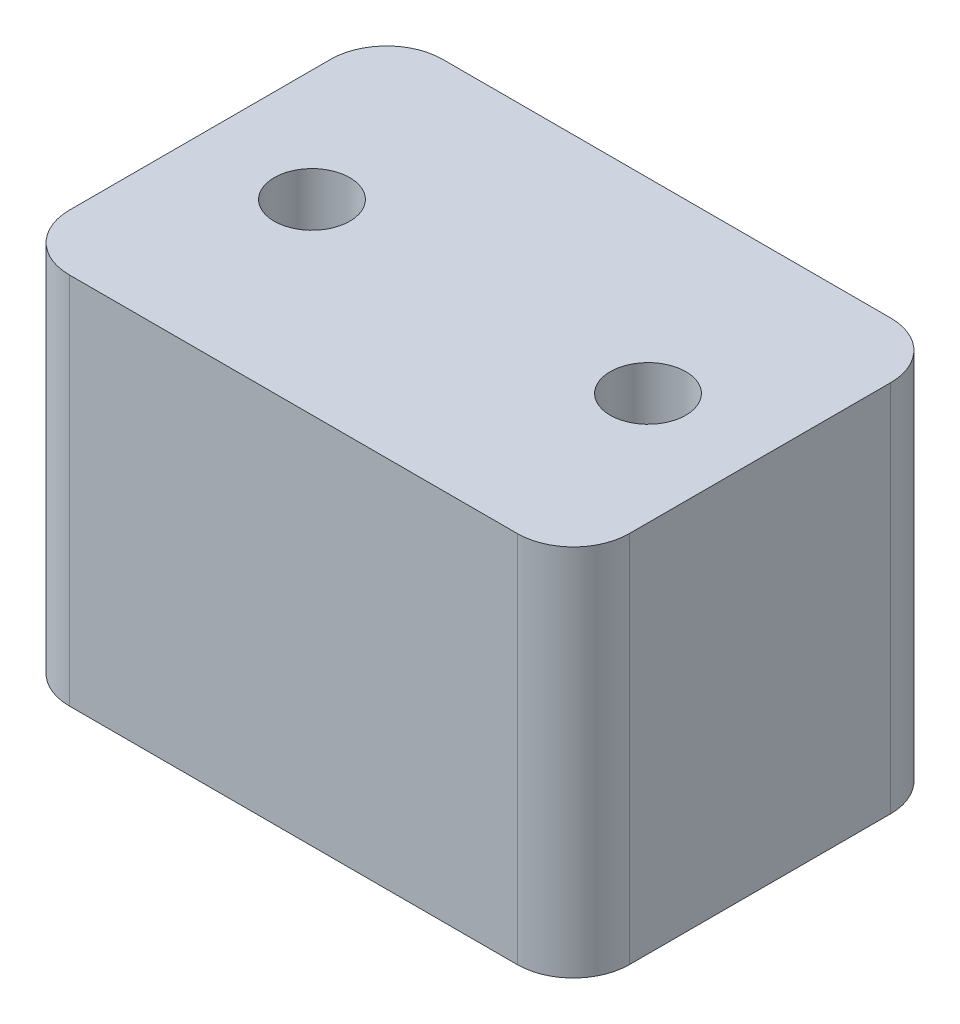
ISO-10303-21;
HEADER;
FILE_DESCRIPTION(('STEP AP214'),'2;1');
FILE_NAME('part.step','',(''),(''),'','','');
FILE_SCHEMA(('AUTOMOTIVE_DESIGN { 1 0 10303 214 1 1 1 1 }'));
ENDSEC;
DATA;
#1=APPLICATION_CONTEXT('core data for automotive mechanical design processes');
#2=APPLICATION_PROTOCOL_DEFINITION('international standard','automotive_design',2000,#1);
#3=PRODUCT_CONTEXT('',#1,'mechanical');
#4=PRODUCT('Part','Part','',(#3));
#5=PRODUCT_RELATED_PRODUCT_CATEGORY('part','',(#4));
#6=PRODUCT_DEFINITION_FORMATION('','',#4);
#7=PRODUCT_DEFINITION_CONTEXT('part definition',#1,'design');
#8=PRODUCT_DEFINITION('design','',#6,#7);
#9=PRODUCT_DEFINITION_SHAPE('','',#8);
#10=(LENGTH_UNIT() NAMED_UNIT(*) SI_UNIT(.MILLI.,.METRE.));
#11=(NAMED_UNIT(*) PLANE_ANGLE_UNIT() SI_UNIT($,.RADIAN.));
#12=(NAMED_UNIT(*) SI_UNIT($,.STERADIAN.) SOLID_ANGLE_UNIT());
#13=UNCERTAINTY_MEASURE_WITH_UNIT(LENGTH_MEASURE(1.E-05),#10,'distance_accuracy_value','');
#14=(GEOMETRIC_REPRESENTATION_CONTEXT(3) GLOBAL_UNCERTAINTY_ASSIGNED_CONTEXT((#13)) GLOBAL_UNIT_ASSIGNED_CONTEXT((#10,
#11,#12)) REPRESENTATION_CONTEXT('',''));
#15=CARTESIAN_POINT('',(0.,0.,0.));
#16=DIRECTION('',(0.,0.,1.));
#17=DIRECTION('',(1.,0.,0.));
#18=AXIS2_PLACEMENT_3D('',#15,#16,#17);
#19=CARTESIAN_POINT('',(15.,20.,10.));
#20=DIRECTION('',(-1.,0.,0.));
#21=DIRECTION('',(0.,0.,1.));
#22=AXIS2_PLACEMENT_3D('',#19,#20,#21);
#23=PLANE('',#22);
#24=DIRECTION('',(0.,0.,-1.));
#25=VECTOR('',#24,1.);
#26=CARTESIAN_POINT('',(15.,0.,10.));
#27=LINE('',#26,#25);
#28=CARTESIAN_POINT('',(15.,0.,7.));
#29=VERTEX_POINT('',#28);
#30=CARTESIAN_POINT('',(15.,0.,-7.));
#31=VERTEX_POINT('',#30);
#32=EDGE_CURVE('E182',#29,#31,#27,.T.);
#33=ORIENTED_EDGE('',*,*,#32,.T.);
#34=DIRECTION('',(0.,-1.,0.));
#35=VECTOR('',#34,1.);
#36=CARTESIAN_POINT('',(15.,20.,-7.));
#37=LINE('',#36,#35);
#38=CARTESIAN_POINT('',(15.,20.,-7.));
#39=VERTEX_POINT('',#38);
#40=EDGE_CURVE('E11',#31,#39,#37,.F.);
#41=ORIENTED_EDGE('',*,*,#40,.T.);
#42=DIRECTION('',(0.,0.,-1.));
#43=VECTOR('',#42,1.);
#44=CARTESIAN_POINT('',(15.,20.,10.));
#45=LINE('',#44,#43);
#46=CARTESIAN_POINT('',(15.,20.,7.));
#47=VERTEX_POINT('',#46);
#48=EDGE_CURVE('E135',#47,#39,#45,.T.);
#49=ORIENTED_EDGE('',*,*,#48,.F.);
#50=DIRECTION('',(0.,-1.,0.));
#51=VECTOR('',#50,1.);
#52=CARTESIAN_POINT('',(15.,20.,7.));
#53=LINE('',#52,#51);
#54=EDGE_CURVE('E48',#47,#29,#53,.T.);
#55=ORIENTED_EDGE('',*,*,#54,.T.);
#56=EDGE_LOOP('',(#33,#41,#49,#55));
#57=FACE_BOUND('',#56,.T.);
#58=ADVANCED_FACE('F39',(#57),#23,.F.);
#59=CARTESIAN_POINT('',(-15.,20.,-10.));
#60=DIRECTION('',(0.,0.,1.));
#61=DIRECTION('',(1.,0.,0.));
#62=AXIS2_PLACEMENT_3D('',#59,#60,#61);
#63=PLANE('',#62);
#64=DIRECTION('',(-1.,0.,0.));
#65=VECTOR('',#64,1.);
#66=CARTESIAN_POINT('',(-15.,0.,-10.));
#67=LINE('',#66,#65);
#68=CARTESIAN_POINT('',(12.,0.,-10.));
#69=VERTEX_POINT('',#68);
#70=CARTESIAN_POINT('',(-12.,0.,-10.));
#71=VERTEX_POINT('',#70);
#72=EDGE_CURVE('E144',#69,#71,#67,.T.);
#73=ORIENTED_EDGE('',*,*,#72,.T.);
#74=DIRECTION('',(0.,-1.,0.));
#75=VECTOR('',#74,1.);
#76=CARTESIAN_POINT('',(-12.,20.,-10.));
#77=LINE('',#76,#75);
#78=CARTESIAN_POINT('',(-12.,20.,-10.));
#79=VERTEX_POINT('',#78);
#80=EDGE_CURVE('E55',#71,#79,#77,.F.);
#81=ORIENTED_EDGE('',*,*,#80,.T.);
#82=DIRECTION('',(-1.,0.,0.));
#83=VECTOR('',#82,1.);
#84=CARTESIAN_POINT('',(-15.,20.,-10.));
#85=LINE('',#84,#83);
#86=CARTESIAN_POINT('',(12.,20.,-10.));
#87=VERTEX_POINT('',#86);
#88=EDGE_CURVE('E141',#87,#79,#85,.T.);
#89=ORIENTED_EDGE('',*,*,#88,.F.);
#90=DIRECTION('',(0.,-1.,0.));
#91=VECTOR('',#90,1.);
#92=CARTESIAN_POINT('',(12.,20.,-10.));
#93=LINE('',#92,#91);
#94=EDGE_CURVE('E172',#87,#69,#93,.T.);
#95=ORIENTED_EDGE('',*,*,#94,.T.);
#96=EDGE_LOOP('',(#73,#81,#89,#95));
#97=FACE_BOUND('',#96,.T.);
#98=ADVANCED_FACE('F230',(#97),#63,.F.);
#99=CARTESIAN_POINT('',(-15.,20.,10.));
#100=DIRECTION('',(1.,0.,0.));
#101=DIRECTION('',(0.,0.,-1.));
#102=AXIS2_PLACEMENT_3D('',#99,#100,#101);
#103=PLANE('',#102);
#104=DIRECTION('',(0.,0.,1.));
#105=VECTOR('',#104,1.);
#106=CARTESIAN_POINT('',(-15.,0.,10.));
#107=LINE('',#106,#105);
#108=CARTESIAN_POINT('',(-15.,0.,-7.));
#109=VERTEX_POINT('',#108);
#110=CARTESIAN_POINT('',(-15.,0.,7.));
#111=VERTEX_POINT('',#110);
#112=EDGE_CURVE('E136',#109,#111,#107,.T.);
#113=ORIENTED_EDGE('',*,*,#112,.T.);
#114=DIRECTION('',(0.,-1.,0.));
#115=VECTOR('',#114,1.);
#116=CARTESIAN_POINT('',(-15.,20.,7.));
#117=LINE('',#116,#115);
#118=CARTESIAN_POINT('',(-15.,20.,7.));
#119=VERTEX_POINT('',#118);
#120=EDGE_CURVE('E111',#111,#119,#117,.F.);
#121=ORIENTED_EDGE('',*,*,#120,.T.);
#122=DIRECTION('',(0.,0.,1.));
#123=VECTOR('',#122,1.);
#124=CARTESIAN_POINT('',(-15.,20.,10.));
#125=LINE('',#124,#123);
#126=CARTESIAN_POINT('',(-15.,20.,-7.));
#127=VERTEX_POINT('',#126);
#128=EDGE_CURVE('E198',#127,#119,#125,.T.);
#129=ORIENTED_EDGE('',*,*,#128,.F.);
#130=DIRECTION('',(0.,-1.,0.));
#131=VECTOR('',#130,1.);
#132=CARTESIAN_POINT('',(-15.,20.,-7.));
#133=LINE('',#132,#131);
#134=EDGE_CURVE('E117',#127,#109,#133,.T.);
#135=ORIENTED_EDGE('',*,*,#134,.T.);
#136=EDGE_LOOP('',(#113,#121,#129,#135));
#137=FACE_BOUND('',#136,.T.);
#138=ADVANCED_FACE('F227',(#137),#103,.F.);
#139=CARTESIAN_POINT('',(-15.,20.,10.));
#140=DIRECTION('',(0.,0.,-1.));
#141=DIRECTION('',(-1.,0.,0.));
#142=AXIS2_PLACEMENT_3D('',#139,#140,#141);
#143=PLANE('',#142);
#144=DIRECTION('',(1.,0.,0.));
#145=VECTOR('',#144,1.);
#146=CARTESIAN_POINT('',(-15.,20.,10.));
#147=LINE('',#146,#145);
#148=CARTESIAN_POINT('',(-12.,20.,10.));
#149=VERTEX_POINT('',#148);
#150=CARTESIAN_POINT('',(12.,20.,10.));
#151=VERTEX_POINT('',#150);
#152=EDGE_CURVE('E127',#149,#151,#147,.T.);
#153=ORIENTED_EDGE('',*,*,#152,.F.);
#154=DIRECTION('',(0.,-1.,0.));
#155=VECTOR('',#154,1.);
#156=CARTESIAN_POINT('',(-12.,20.,10.));
#157=LINE('',#156,#155);
#158=CARTESIAN_POINT('',(-12.,0.,10.));
#159=VERTEX_POINT('',#158);
#160=EDGE_CURVE('E110',#149,#159,#157,.T.);
#161=ORIENTED_EDGE('',*,*,#160,.T.);
#162=DIRECTION('',(1.,0.,0.));
#163=VECTOR('',#162,1.);
#164=CARTESIAN_POINT('',(-15.,0.,10.));
#165=LINE('',#164,#163);
#166=CARTESIAN_POINT('',(12.,0.,10.));
#167=VERTEX_POINT('',#166);
#168=EDGE_CURVE('E124',#159,#167,#165,.T.);
#169=ORIENTED_EDGE('',*,*,#168,.T.);
#170=DIRECTION('',(0.,-1.,0.));
#171=VECTOR('',#170,1.);
#172=CARTESIAN_POINT('',(12.,20.,10.));
#173=LINE('',#172,#171);
#174=EDGE_CURVE('E130',#167,#151,#173,.F.);
#175=ORIENTED_EDGE('',*,*,#174,.T.);
#176=EDGE_LOOP('',(#153,#161,#169,#175));
#177=FACE_BOUND('',#176,.T.);
#178=ADVANCED_FACE('F123',(#177),#143,.F.);
#179=CARTESIAN_POINT('',(0.,20.,0.));
#180=DIRECTION('',(0.,-1.,0.));
#181=DIRECTION('',(0.,0.,-1.));
#182=AXIS2_PLACEMENT_3D('',#179,#180,#181);
#183=PLANE('',#182);
#184=CARTESIAN_POINT('',(-9.,20.,0.));
#185=DIRECTION('',(0.,1.,0.));
#186=DIRECTION('',(0.,0.,1.));
#187=AXIS2_PLACEMENT_3D('',#184,#185,#186);
#188=CIRCLE('',#187,2.025);
#189=CARTESIAN_POINT('',(-9.,20.,2.025));
#190=VERTEX_POINT('',#189);
#191=EDGE_CURVE('E193',#190,#190,#188,.T.);
#192=ORIENTED_EDGE('',*,*,#191,.F.);
#193=EDGE_LOOP('',(#192));
#194=FACE_BOUND('',#193,.T.);
#195=CARTESIAN_POINT('',(9.,20.,0.));
#196=DIRECTION('',(0.,1.,0.));
#197=DIRECTION('',(0.,0.,1.));
#198=AXIS2_PLACEMENT_3D('',#195,#196,#197);
#199=CIRCLE('',#198,2.025);
#200=CARTESIAN_POINT('',(9.,20.,2.025));
#201=VERTEX_POINT('',#200);
#202=EDGE_CURVE('E204',#201,#201,#199,.T.);
#203=ORIENTED_EDGE('',*,*,#202,.F.);
#204=EDGE_LOOP('',(#203));
#205=FACE_BOUND('',#204,.T.);
#206=ORIENTED_EDGE('',*,*,#128,.T.);
#207=CARTESIAN_POINT('',(-12.,20.,7.));
#208=DIRECTION('',(0.,-1.,0.));
#209=DIRECTION('',(0.,0.,-1.));
#210=AXIS2_PLACEMENT_3D('',#207,#208,#209);
#211=CIRCLE('',#210,3.);
#212=EDGE_CURVE('E169',#119,#149,#211,.F.);
#213=ORIENTED_EDGE('',*,*,#212,.T.);
#214=ORIENTED_EDGE('',*,*,#152,.T.);
#215=CARTESIAN_POINT('',(12.,20.,7.));
#216=DIRECTION('',(0.,-1.,0.));
#217=DIRECTION('',(0.,0.,-1.));
#218=AXIS2_PLACEMENT_3D('',#215,#216,#217);
#219=CIRCLE('',#218,3.);
#220=EDGE_CURVE('E161',#151,#47,#219,.F.);
#221=ORIENTED_EDGE('',*,*,#220,.T.);
#222=ORIENTED_EDGE('',*,*,#48,.T.);
#223=CARTESIAN_POINT('',(12.,20.,-7.));
#224=DIRECTION('',(0.,-1.,0.));
#225=DIRECTION('',(0.,0.,-1.));
#226=AXIS2_PLACEMENT_3D('',#223,#224,#225);
#227=CIRCLE('',#226,3.);
#228=EDGE_CURVE('E62',#39,#87,#227,.F.);
#229=ORIENTED_EDGE('',*,*,#228,.T.);
#230=ORIENTED_EDGE('',*,*,#88,.T.);
#231=CARTESIAN_POINT('',(-12.,20.,-7.));
#232=DIRECTION('',(0.,-1.,0.));
#233=DIRECTION('',(0.,0.,-1.));
#234=AXIS2_PLACEMENT_3D('',#231,#232,#233);
#235=CIRCLE('',#234,3.);
#236=EDGE_CURVE('E166',#79,#127,#235,.F.);
#237=ORIENTED_EDGE('',*,*,#236,.T.);
#238=EDGE_LOOP('',(#206,#213,#214,#221,#222,#229,#230,#237));
#239=FACE_BOUND('',#238,.T.);
#240=ADVANCED_FACE('F218',(#194,#205,#239),#183,.F.);
#241=CARTESIAN_POINT('',(0.,0.,0.));
#242=DIRECTION('',(0.,-1.,0.));
#243=DIRECTION('',(0.,0.,-1.));
#244=AXIS2_PLACEMENT_3D('',#241,#242,#243);
#245=PLANE('',#244);
#246=CARTESIAN_POINT('',(-9.,0.,0.));
#247=DIRECTION('',(0.,1.,0.));
#248=DIRECTION('',(0.,0.,1.));
#249=AXIS2_PLACEMENT_3D('',#246,#247,#248);
#250=CIRCLE('',#249,2.025);
#251=CARTESIAN_POINT('',(-9.,0.,2.025));
#252=VERTEX_POINT('',#251);
#253=EDGE_CURVE('E188',#252,#252,#250,.T.);
#254=ORIENTED_EDGE('',*,*,#253,.T.);
#255=EDGE_LOOP('',(#254));
#256=FACE_BOUND('',#255,.T.);
#257=CARTESIAN_POINT('',(9.,0.,0.));
#258=DIRECTION('',(0.,1.,0.));
#259=DIRECTION('',(0.,0.,1.));
#260=AXIS2_PLACEMENT_3D('',#257,#258,#259);
#261=CIRCLE('',#260,2.025);
#262=CARTESIAN_POINT('',(9.,0.,2.025));
#263=VERTEX_POINT('',#262);
#264=EDGE_CURVE('E208',#263,#263,#261,.T.);
#265=ORIENTED_EDGE('',*,*,#264,.T.);
#266=EDGE_LOOP('',(#265));
#267=FACE_BOUND('',#266,.T.);
#268=ORIENTED_EDGE('',*,*,#168,.F.);
#269=CARTESIAN_POINT('',(-12.,0.,7.));
#270=DIRECTION('',(0.,-1.,0.));
#271=DIRECTION('',(0.,0.,-1.));
#272=AXIS2_PLACEMENT_3D('',#269,#270,#271);
#273=CIRCLE('',#272,3.);
#274=EDGE_CURVE('E106',#159,#111,#273,.T.);
#275=ORIENTED_EDGE('',*,*,#274,.T.);
#276=ORIENTED_EDGE('',*,*,#112,.F.);
#277=CARTESIAN_POINT('',(-12.,0.,-7.));
#278=DIRECTION('',(0.,-1.,0.));
#279=DIRECTION('',(0.,0.,-1.));
#280=AXIS2_PLACEMENT_3D('',#277,#278,#279);
#281=CIRCLE('',#280,3.);
#282=EDGE_CURVE('E118',#109,#71,#281,.T.);
#283=ORIENTED_EDGE('',*,*,#282,.T.);
#284=ORIENTED_EDGE('',*,*,#72,.F.);
#285=CARTESIAN_POINT('',(12.,0.,-7.));
#286=DIRECTION('',(0.,-1.,0.));
#287=DIRECTION('',(0.,0.,-1.));
#288=AXIS2_PLACEMENT_3D('',#285,#286,#287);
#289=CIRCLE('',#288,3.);
#290=EDGE_CURVE('E152',#69,#31,#289,.T.);
#291=ORIENTED_EDGE('',*,*,#290,.T.);
#292=ORIENTED_EDGE('',*,*,#32,.F.);
#293=CARTESIAN_POINT('',(12.,0.,7.));
#294=DIRECTION('',(0.,-1.,0.));
#295=DIRECTION('',(0.,0.,-1.));
#296=AXIS2_PLACEMENT_3D('',#293,#294,#295);
#297=CIRCLE('',#296,3.);
#298=EDGE_CURVE('E129',#29,#167,#297,.T.);
#299=ORIENTED_EDGE('',*,*,#298,.T.);
#300=EDGE_LOOP('',(#268,#275,#276,#283,#284,#291,#292,#299));
#301=FACE_BOUND('',#300,.T.);
#302=ADVANCED_FACE('F132',(#256,#267,#301),#245,.T.);
#303=CARTESIAN_POINT('',(9.,0.,0.));
#304=DIRECTION('',(0.,1.,0.));
#305=DIRECTION('',(0.,0.,1.));
#306=AXIS2_PLACEMENT_3D('',#303,#304,#305);
#307=CYLINDRICAL_SURFACE('',#306,2.025);
#308=ORIENTED_EDGE('',*,*,#264,.F.);
#309=EDGE_LOOP('',(#308));
#310=FACE_BOUND('',#309,.T.);
#311=ORIENTED_EDGE('',*,*,#202,.T.);
#312=EDGE_LOOP('',(#311));
#313=FACE_BOUND('',#312,.T.);
#314=ADVANCED_FACE('F282',(#310,#313),#307,.F.);
#315=CARTESIAN_POINT('',(-9.,0.,0.));
#316=DIRECTION('',(0.,1.,0.));
#317=DIRECTION('',(0.,0.,1.));
#318=AXIS2_PLACEMENT_3D('',#315,#316,#317);
#319=CYLINDRICAL_SURFACE('',#318,2.025);
#320=ORIENTED_EDGE('',*,*,#253,.F.);
#321=EDGE_LOOP('',(#320));
#322=FACE_BOUND('',#321,.T.);
#323=ORIENTED_EDGE('',*,*,#191,.T.);
#324=EDGE_LOOP('',(#323));
#325=FACE_BOUND('',#324,.T.);
#326=ADVANCED_FACE('F216',(#322,#325),#319,.F.);
#327=CARTESIAN_POINT('',(-12.,20.,7.));
#328=DIRECTION('',(0.,-1.,0.));
#329=DIRECTION('',(0.,0.,-1.));
#330=AXIS2_PLACEMENT_3D('',#327,#328,#329);
#331=CYLINDRICAL_SURFACE('',#330,3.);
#332=ORIENTED_EDGE('',*,*,#212,.F.);
#333=ORIENTED_EDGE('',*,*,#120,.F.);
#334=ORIENTED_EDGE('',*,*,#274,.F.);
#335=ORIENTED_EDGE('',*,*,#160,.F.);
#336=EDGE_LOOP('',(#332,#333,#334,#335));
#337=FACE_BOUND('',#336,.T.);
#338=ADVANCED_FACE('F109',(#337),#331,.T.);
#339=CARTESIAN_POINT('',(-12.,20.,-7.));
#340=DIRECTION('',(0.,-1.,0.));
#341=DIRECTION('',(0.,0.,-1.));
#342=AXIS2_PLACEMENT_3D('',#339,#340,#341);
#343=CYLINDRICAL_SURFACE('',#342,3.);
#344=ORIENTED_EDGE('',*,*,#236,.F.);
#345=ORIENTED_EDGE('',*,*,#80,.F.);
#346=ORIENTED_EDGE('',*,*,#282,.F.);
#347=ORIENTED_EDGE('',*,*,#134,.F.);
#348=EDGE_LOOP('',(#344,#345,#346,#347));
#349=FACE_BOUND('',#348,.T.);
#350=ADVANCED_FACE('F229',(#349),#343,.T.);
#351=CARTESIAN_POINT('',(12.,20.,-7.));
#352=DIRECTION('',(0.,-1.,0.));
#353=DIRECTION('',(0.,0.,-1.));
#354=AXIS2_PLACEMENT_3D('',#351,#352,#353);
#355=CYLINDRICAL_SURFACE('',#354,3.);
#356=ORIENTED_EDGE('',*,*,#228,.F.);
#357=ORIENTED_EDGE('',*,*,#40,.F.);
#358=ORIENTED_EDGE('',*,*,#290,.F.);
#359=ORIENTED_EDGE('',*,*,#94,.F.);
#360=EDGE_LOOP('',(#356,#357,#358,#359));
#361=FACE_BOUND('',#360,.T.);
#362=ADVANCED_FACE('F233',(#361),#355,.T.);
#363=CARTESIAN_POINT('',(12.,20.,7.));
#364=DIRECTION('',(0.,-1.,0.));
#365=DIRECTION('',(0.,0.,-1.));
#366=AXIS2_PLACEMENT_3D('',#363,#364,#365);
#367=CYLINDRICAL_SURFACE('',#366,3.);
#368=ORIENTED_EDGE('',*,*,#220,.F.);
#369=ORIENTED_EDGE('',*,*,#174,.F.);
#370=ORIENTED_EDGE('',*,*,#298,.F.);
#371=ORIENTED_EDGE('',*,*,#54,.F.);
#372=EDGE_LOOP('',(#368,#369,#370,#371));
#373=FACE_BOUND('',#372,.T.);
#374=ADVANCED_FACE('F41',(#373),#367,.T.);
#375=CLOSED_SHELL('',(#58,#98,#138,#178,#240,#302,#314,#326,#338,#350,#362,#374));
#376=MANIFOLD_SOLID_BREP('B2',#375);
#377=ADVANCED_BREP_SHAPE_REPRESENTATION('',(#18,#376),#14);
#378=SHAPE_DEFINITION_REPRESENTATION(#9,#377);
ENDSEC;
END-ISO-10303-21;
